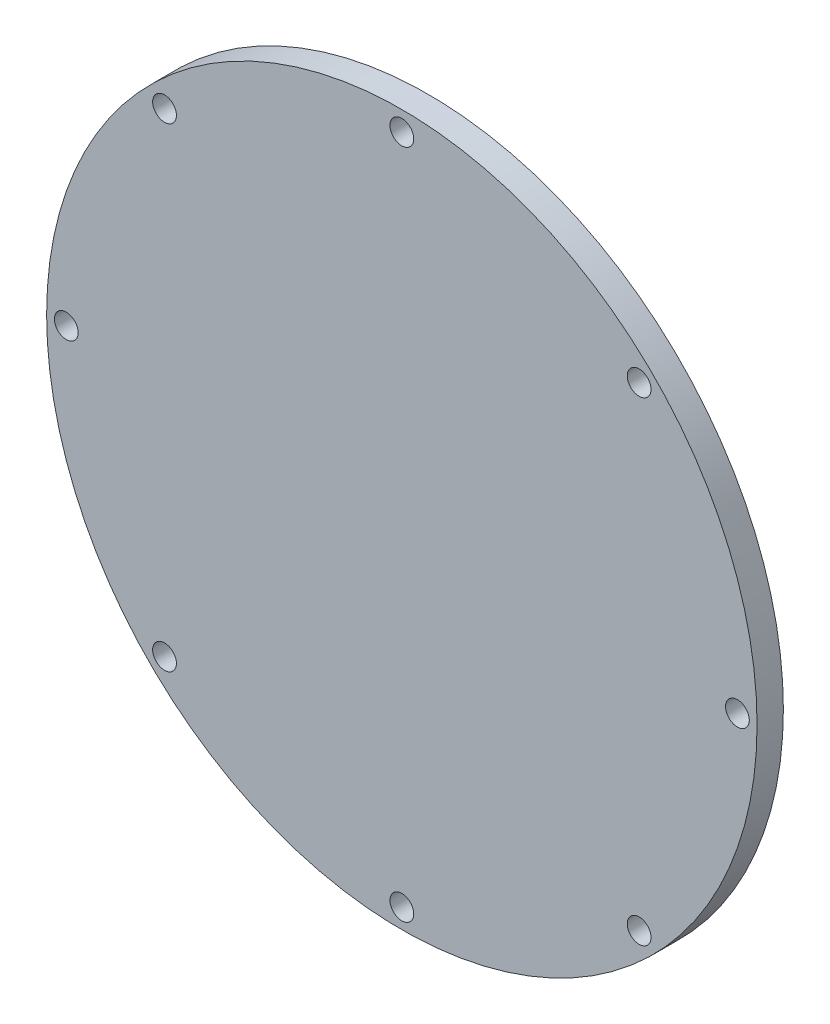
ISO-10303-21;
HEADER;
FILE_DESCRIPTION(('STEP AP214'),'2;1');
FILE_NAME('part.step','',(''),(''),'','','');
FILE_SCHEMA(('AUTOMOTIVE_DESIGN { 1 0 10303 214 1 1 1 1 }'));
ENDSEC;
DATA;
#1=APPLICATION_CONTEXT('core data for automotive mechanical design processes');
#2=APPLICATION_PROTOCOL_DEFINITION('international standard','automotive_design',2000,#1);
#3=PRODUCT_CONTEXT('',#1,'mechanical');
#4=PRODUCT('Part','Part','',(#3));
#5=PRODUCT_RELATED_PRODUCT_CATEGORY('part','',(#4));
#6=PRODUCT_DEFINITION_FORMATION('','',#4);
#7=PRODUCT_DEFINITION_CONTEXT('part definition',#1,'design');
#8=PRODUCT_DEFINITION('design','',#6,#7);
#9=PRODUCT_DEFINITION_SHAPE('','',#8);
#10=(LENGTH_UNIT() NAMED_UNIT(*) SI_UNIT(.MILLI.,.METRE.));
#11=(NAMED_UNIT(*) PLANE_ANGLE_UNIT() SI_UNIT($,.RADIAN.));
#12=(NAMED_UNIT(*) SI_UNIT($,.STERADIAN.) SOLID_ANGLE_UNIT());
#13=UNCERTAINTY_MEASURE_WITH_UNIT(LENGTH_MEASURE(1.E-05),#10,'distance_accuracy_value','');
#14=(GEOMETRIC_REPRESENTATION_CONTEXT(3) GLOBAL_UNCERTAINTY_ASSIGNED_CONTEXT((#13)) GLOBAL_UNIT_ASSIGNED_CONTEXT((#10,
#11,#12)) REPRESENTATION_CONTEXT('',''));
#15=CARTESIAN_POINT('',(0.,0.,0.));
#16=DIRECTION('',(0.,0.,1.));
#17=DIRECTION('',(1.,0.,0.));
#18=AXIS2_PLACEMENT_3D('',#15,#16,#17);
#19=CARTESIAN_POINT('',(0.,0.,5.6));
#20=DIRECTION('',(0.,0.,-1.));
#21=DIRECTION('',(-1.,0.,0.));
#22=AXIS2_PLACEMENT_3D('',#19,#20,#21);
#23=CYLINDRICAL_SURFACE('',#22,75.565);
#24=CARTESIAN_POINT('',(0.,0.,5.6));
#25=DIRECTION('',(0.,0.,1.));
#26=DIRECTION('',(1.,0.,0.));
#27=AXIS2_PLACEMENT_3D('',#24,#25,#26);
#28=CIRCLE('',#27,75.565);
#29=CARTESIAN_POINT('',(75.565,0.,5.6));
#30=VERTEX_POINT('',#29);
#31=EDGE_CURVE('E10',#30,#30,#28,.T.);
#32=ORIENTED_EDGE('',*,*,#31,.F.);
#33=EDGE_LOOP('',(#32));
#34=FACE_BOUND('',#33,.T.);
#35=CARTESIAN_POINT('',(0.,0.,0.));
#36=DIRECTION('',(0.,0.,1.));
#37=DIRECTION('',(1.,0.,0.));
#38=AXIS2_PLACEMENT_3D('',#35,#36,#37);
#39=CIRCLE('',#38,75.565);
#40=CARTESIAN_POINT('',(75.565,0.,0.));
#41=VERTEX_POINT('',#40);
#42=EDGE_CURVE('E51',#41,#41,#39,.T.);
#43=ORIENTED_EDGE('',*,*,#42,.T.);
#44=EDGE_LOOP('',(#43));
#45=FACE_BOUND('',#44,.T.);
#46=ADVANCED_FACE('F43',(#34,#45),#23,.T.);
#47=CARTESIAN_POINT('',(0.,0.,5.6));
#48=DIRECTION('',(0.,0.,1.));
#49=DIRECTION('',(1.,0.,0.));
#50=AXIS2_PLACEMENT_3D('',#47,#48,#49);
#51=PLANE('',#50);
#52=CARTESIAN_POINT('',(50.4780196565297,50.4780196565297,5.6));
#53=DIRECTION('',(0.,0.,1.));
#54=DIRECTION('',(1.,0.,0.));
#55=AXIS2_PLACEMENT_3D('',#52,#53,#54);
#56=CIRCLE('',#55,2.52729999999999);
#57=CARTESIAN_POINT('',(53.0053196565297,50.4780196565297,5.6));
#58=VERTEX_POINT('',#57);
#59=EDGE_CURVE('E110',#58,#58,#56,.T.);
#60=ORIENTED_EDGE('',*,*,#59,.F.);
#61=EDGE_LOOP('',(#60));
#62=FACE_BOUND('',#61,.T.);
#63=CARTESIAN_POINT('',(0.,71.3867,5.6));
#64=DIRECTION('',(0.,0.,1.));
#65=DIRECTION('',(1.,0.,0.));
#66=AXIS2_PLACEMENT_3D('',#63,#64,#65);
#67=CIRCLE('',#66,2.52729999999999);
#68=CARTESIAN_POINT('',(2.52729999999999,71.3867,5.6));
#69=VERTEX_POINT('',#68);
#70=EDGE_CURVE('E102',#69,#69,#67,.T.);
#71=ORIENTED_EDGE('',*,*,#70,.F.);
#72=EDGE_LOOP('',(#71));
#73=FACE_BOUND('',#72,.T.);
#74=CARTESIAN_POINT('',(-50.4780196565297,50.4780196565297,5.6));
#75=DIRECTION('',(0.,0.,1.));
#76=DIRECTION('',(1.,0.,0.));
#77=AXIS2_PLACEMENT_3D('',#74,#75,#76);
#78=CIRCLE('',#77,2.52729999999999);
#79=CARTESIAN_POINT('',(-47.9507196565297,50.4780196565297,5.6));
#80=VERTEX_POINT('',#79);
#81=EDGE_CURVE('E94',#80,#80,#78,.T.);
#82=ORIENTED_EDGE('',*,*,#81,.F.);
#83=EDGE_LOOP('',(#82));
#84=FACE_BOUND('',#83,.T.);
#85=CARTESIAN_POINT('',(-71.3867,0.,5.6));
#86=DIRECTION('',(0.,0.,1.));
#87=DIRECTION('',(1.,0.,0.));
#88=AXIS2_PLACEMENT_3D('',#85,#86,#87);
#89=CIRCLE('',#88,2.52729999999999);
#90=CARTESIAN_POINT('',(-68.8594,0.,5.6));
#91=VERTEX_POINT('',#90);
#92=EDGE_CURVE('E86',#91,#91,#89,.T.);
#93=ORIENTED_EDGE('',*,*,#92,.F.);
#94=EDGE_LOOP('',(#93));
#95=FACE_BOUND('',#94,.T.);
#96=CARTESIAN_POINT('',(-50.4780196565297,-50.4780196565297,5.6));
#97=DIRECTION('',(0.,0.,1.));
#98=DIRECTION('',(1.,0.,0.));
#99=AXIS2_PLACEMENT_3D('',#96,#97,#98);
#100=CIRCLE('',#99,2.52729999999999);
#101=CARTESIAN_POINT('',(-47.9507196565297,-50.4780196565297,5.6));
#102=VERTEX_POINT('',#101);
#103=EDGE_CURVE('E78',#102,#102,#100,.T.);
#104=ORIENTED_EDGE('',*,*,#103,.F.);
#105=EDGE_LOOP('',(#104));
#106=FACE_BOUND('',#105,.T.);
#107=CARTESIAN_POINT('',(0.,-71.3867,5.6));
#108=DIRECTION('',(0.,0.,1.));
#109=DIRECTION('',(1.,0.,0.));
#110=AXIS2_PLACEMENT_3D('',#107,#108,#109);
#111=CIRCLE('',#110,2.52729999999999);
#112=CARTESIAN_POINT('',(2.52729999999999,-71.3867,5.6));
#113=VERTEX_POINT('',#112);
#114=EDGE_CURVE('E70',#113,#113,#111,.T.);
#115=ORIENTED_EDGE('',*,*,#114,.F.);
#116=EDGE_LOOP('',(#115));
#117=FACE_BOUND('',#116,.T.);
#118=CARTESIAN_POINT('',(50.4780196565297,-50.4780196565297,5.6));
#119=DIRECTION('',(0.,0.,1.));
#120=DIRECTION('',(1.,0.,0.));
#121=AXIS2_PLACEMENT_3D('',#118,#119,#120);
#122=CIRCLE('',#121,2.52729999999999);
#123=CARTESIAN_POINT('',(53.0053196565297,-50.4780196565297,5.6));
#124=VERTEX_POINT('',#123);
#125=EDGE_CURVE('E62',#124,#124,#122,.T.);
#126=ORIENTED_EDGE('',*,*,#125,.F.);
#127=EDGE_LOOP('',(#126));
#128=FACE_BOUND('',#127,.T.);
#129=CARTESIAN_POINT('',(71.3867,0.,5.6));
#130=DIRECTION('',(0.,0.,1.));
#131=DIRECTION('',(1.,0.,0.));
#132=AXIS2_PLACEMENT_3D('',#129,#130,#131);
#133=CIRCLE('',#132,2.52729999999999);
#134=CARTESIAN_POINT('',(73.914,0.,5.6));
#135=VERTEX_POINT('',#134);
#136=EDGE_CURVE('E46',#135,#135,#133,.T.);
#137=ORIENTED_EDGE('',*,*,#136,.F.);
#138=EDGE_LOOP('',(#137));
#139=FACE_BOUND('',#138,.T.);
#140=ORIENTED_EDGE('',*,*,#31,.T.);
#141=EDGE_LOOP('',(#140));
#142=FACE_BOUND('',#141,.T.);
#143=ADVANCED_FACE('F125',(#62,#73,#84,#95,#106,#117,#128,#139,#142),#51,.T.);
#144=CARTESIAN_POINT('',(0.,0.,0.));
#145=DIRECTION('',(0.,0.,1.));
#146=DIRECTION('',(1.,0.,0.));
#147=AXIS2_PLACEMENT_3D('',#144,#145,#146);
#148=PLANE('',#147);
#149=CARTESIAN_POINT('',(50.4780196565297,50.4780196565297,0.));
#150=DIRECTION('',(0.,0.,-1.));
#151=DIRECTION('',(-1.,0.,0.));
#152=AXIS2_PLACEMENT_3D('',#149,#150,#151);
#153=CIRCLE('',#152,2.52729999999999);
#154=CARTESIAN_POINT('',(47.9507196565297,50.4780196565297,0.));
#155=VERTEX_POINT('',#154);
#156=EDGE_CURVE('E114',#155,#155,#153,.T.);
#157=ORIENTED_EDGE('',*,*,#156,.F.);
#158=EDGE_LOOP('',(#157));
#159=FACE_BOUND('',#158,.T.);
#160=CARTESIAN_POINT('',(0.,71.3867,0.));
#161=DIRECTION('',(0.,0.,-1.));
#162=DIRECTION('',(-1.,0.,0.));
#163=AXIS2_PLACEMENT_3D('',#160,#161,#162);
#164=CIRCLE('',#163,2.52729999999999);
#165=CARTESIAN_POINT('',(-2.52729999999999,71.3867,0.));
#166=VERTEX_POINT('',#165);
#167=EDGE_CURVE('E106',#166,#166,#164,.T.);
#168=ORIENTED_EDGE('',*,*,#167,.F.);
#169=EDGE_LOOP('',(#168));
#170=FACE_BOUND('',#169,.T.);
#171=CARTESIAN_POINT('',(-50.4780196565297,50.4780196565297,0.));
#172=DIRECTION('',(0.,0.,-1.));
#173=DIRECTION('',(-1.,0.,0.));
#174=AXIS2_PLACEMENT_3D('',#171,#172,#173);
#175=CIRCLE('',#174,2.52729999999999);
#176=CARTESIAN_POINT('',(-53.0053196565297,50.4780196565297,0.));
#177=VERTEX_POINT('',#176);
#178=EDGE_CURVE('E98',#177,#177,#175,.T.);
#179=ORIENTED_EDGE('',*,*,#178,.F.);
#180=EDGE_LOOP('',(#179));
#181=FACE_BOUND('',#180,.T.);
#182=CARTESIAN_POINT('',(-71.3867,0.,0.));
#183=DIRECTION('',(0.,0.,-1.));
#184=DIRECTION('',(-1.,0.,0.));
#185=AXIS2_PLACEMENT_3D('',#182,#183,#184);
#186=CIRCLE('',#185,2.52729999999998);
#187=CARTESIAN_POINT('',(-73.914,0.,0.));
#188=VERTEX_POINT('',#187);
#189=EDGE_CURVE('E90',#188,#188,#186,.T.);
#190=ORIENTED_EDGE('',*,*,#189,.F.);
#191=EDGE_LOOP('',(#190));
#192=FACE_BOUND('',#191,.T.);
#193=CARTESIAN_POINT('',(-50.4780196565297,-50.4780196565297,0.));
#194=DIRECTION('',(0.,0.,-1.));
#195=DIRECTION('',(-1.,0.,0.));
#196=AXIS2_PLACEMENT_3D('',#193,#194,#195);
#197=CIRCLE('',#196,2.52729999999999);
#198=CARTESIAN_POINT('',(-53.0053196565297,-50.4780196565297,0.));
#199=VERTEX_POINT('',#198);
#200=EDGE_CURVE('E82',#199,#199,#197,.T.);
#201=ORIENTED_EDGE('',*,*,#200,.F.);
#202=EDGE_LOOP('',(#201));
#203=FACE_BOUND('',#202,.T.);
#204=CARTESIAN_POINT('',(0.,-71.3867,0.));
#205=DIRECTION('',(0.,0.,-1.));
#206=DIRECTION('',(-1.,0.,0.));
#207=AXIS2_PLACEMENT_3D('',#204,#205,#206);
#208=CIRCLE('',#207,2.52729999999999);
#209=CARTESIAN_POINT('',(-2.52729999999999,-71.3867,0.));
#210=VERTEX_POINT('',#209);
#211=EDGE_CURVE('E74',#210,#210,#208,.T.);
#212=ORIENTED_EDGE('',*,*,#211,.F.);
#213=EDGE_LOOP('',(#212));
#214=FACE_BOUND('',#213,.T.);
#215=CARTESIAN_POINT('',(50.4780196565297,-50.4780196565297,0.));
#216=DIRECTION('',(0.,0.,-1.));
#217=DIRECTION('',(-1.,0.,0.));
#218=AXIS2_PLACEMENT_3D('',#215,#216,#217);
#219=CIRCLE('',#218,2.52729999999999);
#220=CARTESIAN_POINT('',(47.9507196565297,-50.4780196565297,0.));
#221=VERTEX_POINT('',#220);
#222=EDGE_CURVE('E66',#221,#221,#219,.T.);
#223=ORIENTED_EDGE('',*,*,#222,.F.);
#224=EDGE_LOOP('',(#223));
#225=FACE_BOUND('',#224,.T.);
#226=CARTESIAN_POINT('',(71.3867,0.,0.));
#227=DIRECTION('',(0.,0.,-1.));
#228=DIRECTION('',(-1.,0.,0.));
#229=AXIS2_PLACEMENT_3D('',#226,#227,#228);
#230=CIRCLE('',#229,2.52729999999998);
#231=CARTESIAN_POINT('',(68.8594,0.,0.));
#232=VERTEX_POINT('',#231);
#233=EDGE_CURVE('E58',#232,#232,#230,.T.);
#234=ORIENTED_EDGE('',*,*,#233,.F.);
#235=EDGE_LOOP('',(#234));
#236=FACE_BOUND('',#235,.T.);
#237=ORIENTED_EDGE('',*,*,#42,.F.);
#238=EDGE_LOOP('',(#237));
#239=FACE_BOUND('',#238,.T.);
#240=ADVANCED_FACE('F121',(#159,#170,#181,#192,#203,#214,#225,#236,#239),#148,.F.);
#241=CARTESIAN_POINT('',(71.3867,0.,0.));
#242=DIRECTION('',(0.,0.,-1.));
#243=DIRECTION('',(-1.,0.,0.));
#244=AXIS2_PLACEMENT_3D('',#241,#242,#243);
#245=CYLINDRICAL_SURFACE('',#244,2.52729999999999);
#246=ORIENTED_EDGE('',*,*,#136,.T.);
#247=EDGE_LOOP('',(#246));
#248=FACE_BOUND('',#247,.T.);
#249=ORIENTED_EDGE('',*,*,#233,.T.);
#250=EDGE_LOOP('',(#249));
#251=FACE_BOUND('',#250,.T.);
#252=ADVANCED_FACE('F124',(#248,#251),#245,.F.);
#253=CARTESIAN_POINT('',(50.4780196565297,-50.4780196565297,0.));
#254=DIRECTION('',(0.,0.,-1.));
#255=DIRECTION('',(-1.,0.,0.));
#256=AXIS2_PLACEMENT_3D('',#253,#254,#255);
#257=CYLINDRICAL_SURFACE('',#256,2.52729999999999);
#258=ORIENTED_EDGE('',*,*,#125,.T.);
#259=EDGE_LOOP('',(#258));
#260=FACE_BOUND('',#259,.T.);
#261=ORIENTED_EDGE('',*,*,#222,.T.);
#262=EDGE_LOOP('',(#261));
#263=FACE_BOUND('',#262,.T.);
#264=ADVANCED_FACE('F156',(#260,#263),#257,.F.);
#265=CARTESIAN_POINT('',(0.,-71.3867,0.));
#266=DIRECTION('',(0.,0.,-1.));
#267=DIRECTION('',(-1.,0.,0.));
#268=AXIS2_PLACEMENT_3D('',#265,#266,#267);
#269=CYLINDRICAL_SURFACE('',#268,2.52729999999999);
#270=ORIENTED_EDGE('',*,*,#114,.T.);
#271=EDGE_LOOP('',(#270));
#272=FACE_BOUND('',#271,.T.);
#273=ORIENTED_EDGE('',*,*,#211,.T.);
#274=EDGE_LOOP('',(#273));
#275=FACE_BOUND('',#274,.T.);
#276=ADVANCED_FACE('F160',(#272,#275),#269,.F.);
#277=CARTESIAN_POINT('',(-50.4780196565297,-50.4780196565297,0.));
#278=DIRECTION('',(0.,0.,-1.));
#279=DIRECTION('',(-1.,0.,0.));
#280=AXIS2_PLACEMENT_3D('',#277,#278,#279);
#281=CYLINDRICAL_SURFACE('',#280,2.52729999999999);
#282=ORIENTED_EDGE('',*,*,#103,.T.);
#283=EDGE_LOOP('',(#282));
#284=FACE_BOUND('',#283,.T.);
#285=ORIENTED_EDGE('',*,*,#200,.T.);
#286=EDGE_LOOP('',(#285));
#287=FACE_BOUND('',#286,.T.);
#288=ADVANCED_FACE('F164',(#284,#287),#281,.F.);
#289=CARTESIAN_POINT('',(-71.3867,0.,0.));
#290=DIRECTION('',(0.,0.,-1.));
#291=DIRECTION('',(-1.,0.,0.));
#292=AXIS2_PLACEMENT_3D('',#289,#290,#291);
#293=CYLINDRICAL_SURFACE('',#292,2.52729999999999);
#294=ORIENTED_EDGE('',*,*,#92,.T.);
#295=EDGE_LOOP('',(#294));
#296=FACE_BOUND('',#295,.T.);
#297=ORIENTED_EDGE('',*,*,#189,.T.);
#298=EDGE_LOOP('',(#297));
#299=FACE_BOUND('',#298,.T.);
#300=ADVANCED_FACE('F168',(#296,#299),#293,.F.);
#301=CARTESIAN_POINT('',(-50.4780196565297,50.4780196565297,0.));
#302=DIRECTION('',(0.,0.,-1.));
#303=DIRECTION('',(-1.,0.,0.));
#304=AXIS2_PLACEMENT_3D('',#301,#302,#303);
#305=CYLINDRICAL_SURFACE('',#304,2.52729999999999);
#306=ORIENTED_EDGE('',*,*,#81,.T.);
#307=EDGE_LOOP('',(#306));
#308=FACE_BOUND('',#307,.T.);
#309=ORIENTED_EDGE('',*,*,#178,.T.);
#310=EDGE_LOOP('',(#309));
#311=FACE_BOUND('',#310,.T.);
#312=ADVANCED_FACE('F172',(#308,#311),#305,.F.);
#313=CARTESIAN_POINT('',(0.,71.3867,0.));
#314=DIRECTION('',(0.,0.,-1.));
#315=DIRECTION('',(-1.,0.,0.));
#316=AXIS2_PLACEMENT_3D('',#313,#314,#315);
#317=CYLINDRICAL_SURFACE('',#316,2.52729999999999);
#318=ORIENTED_EDGE('',*,*,#70,.T.);
#319=EDGE_LOOP('',(#318));
#320=FACE_BOUND('',#319,.T.);
#321=ORIENTED_EDGE('',*,*,#167,.T.);
#322=EDGE_LOOP('',(#321));
#323=FACE_BOUND('',#322,.T.);
#324=ADVANCED_FACE('F176',(#320,#323),#317,.F.);
#325=CARTESIAN_POINT('',(50.4780196565297,50.4780196565297,0.));
#326=DIRECTION('',(0.,0.,-1.));
#327=DIRECTION('',(-1.,0.,0.));
#328=AXIS2_PLACEMENT_3D('',#325,#326,#327);
#329=CYLINDRICAL_SURFACE('',#328,2.52729999999999);
#330=ORIENTED_EDGE('',*,*,#59,.T.);
#331=EDGE_LOOP('',(#330));
#332=FACE_BOUND('',#331,.T.);
#333=ORIENTED_EDGE('',*,*,#156,.T.);
#334=EDGE_LOOP('',(#333));
#335=FACE_BOUND('',#334,.T.);
#336=ADVANCED_FACE('F119',(#332,#335),#329,.F.);
#337=CLOSED_SHELL('',(#46,#143,#240,#252,#264,#276,#288,#300,#312,#324,#336));
#338=MANIFOLD_SOLID_BREP('B2',#337);
#339=ADVANCED_BREP_SHAPE_REPRESENTATION('',(#18,#338),#14);
#340=SHAPE_DEFINITION_REPRESENTATION(#9,#339);
ENDSEC;
END-ISO-10303-21;
